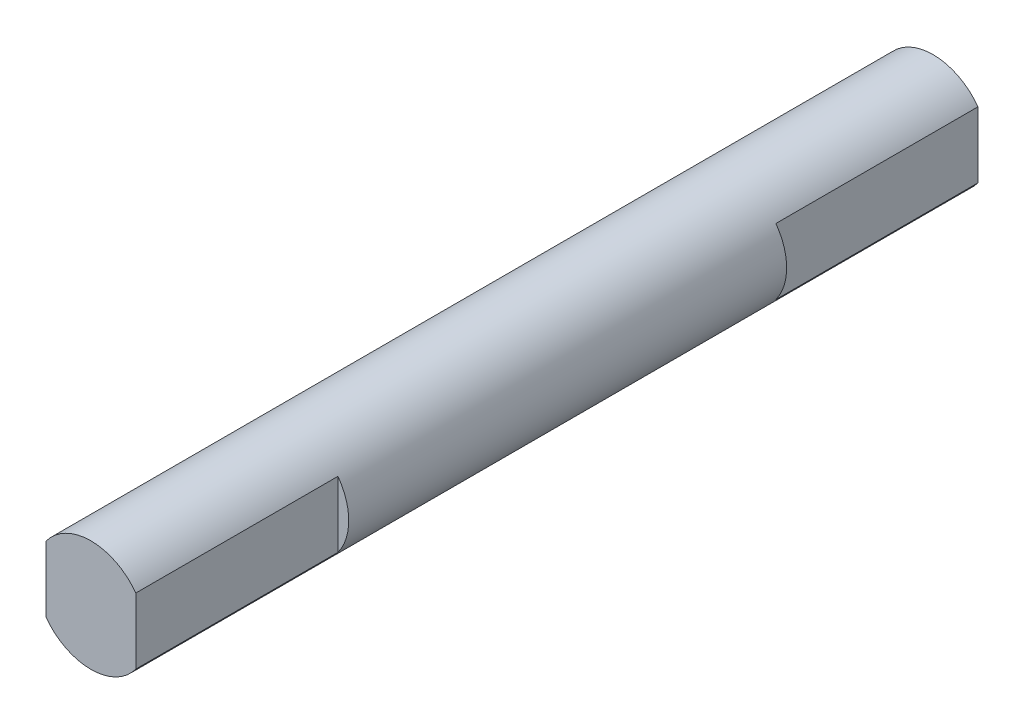
ISO-10303-21;
HEADER;
FILE_DESCRIPTION(('STEP AP214'),'2;1');
FILE_NAME('part.step','',(''),(''),'','','');
FILE_SCHEMA(('AUTOMOTIVE_DESIGN { 1 0 10303 214 1 1 1 1 }'));
ENDSEC;
DATA;
#1=APPLICATION_CONTEXT('core data for automotive mechanical design processes');
#2=APPLICATION_PROTOCOL_DEFINITION('international standard','automotive_design',2000,#1);
#3=PRODUCT_CONTEXT('',#1,'mechanical');
#4=PRODUCT('Part','Part','',(#3));
#5=PRODUCT_RELATED_PRODUCT_CATEGORY('part','',(#4));
#6=PRODUCT_DEFINITION_FORMATION('','',#4);
#7=PRODUCT_DEFINITION_CONTEXT('part definition',#1,'design');
#8=PRODUCT_DEFINITION('design','',#6,#7);
#9=PRODUCT_DEFINITION_SHAPE('','',#8);
#10=(LENGTH_UNIT() NAMED_UNIT(*) SI_UNIT(.MILLI.,.METRE.));
#11=(NAMED_UNIT(*) PLANE_ANGLE_UNIT() SI_UNIT($,.RADIAN.));
#12=(NAMED_UNIT(*) SI_UNIT($,.STERADIAN.) SOLID_ANGLE_UNIT());
#13=UNCERTAINTY_MEASURE_WITH_UNIT(LENGTH_MEASURE(1.E-05),#10,'distance_accuracy_value','');
#14=(GEOMETRIC_REPRESENTATION_CONTEXT(3) GLOBAL_UNCERTAINTY_ASSIGNED_CONTEXT((#13)) GLOBAL_UNIT_ASSIGNED_CONTEXT((#10,
#11,#12)) REPRESENTATION_CONTEXT('',''));
#15=CARTESIAN_POINT('',(0.,0.,0.));
#16=DIRECTION('',(0.,0.,1.));
#17=DIRECTION('',(1.,0.,0.));
#18=AXIS2_PLACEMENT_3D('',#15,#16,#17);
#19=CARTESIAN_POINT('',(0.,0.,-6.5));
#20=DIRECTION('',(0.,0.,-1.));
#21=DIRECTION('',(-1.,0.,0.));
#22=AXIS2_PLACEMENT_3D('',#19,#20,#21);
#23=PLANE('',#22);
#24=CARTESIAN_POINT('',(0.,0.,-6.5));
#25=DIRECTION('',(0.,0.,-1.));
#26=DIRECTION('',(-1.,0.,0.));
#27=AXIS2_PLACEMENT_3D('',#24,#25,#26);
#28=CIRCLE('',#27,2.48);
#29=CARTESIAN_POINT('',(-2.,-1.46642422238587,-6.5));
#30=VERTEX_POINT('',#29);
#31=CARTESIAN_POINT('',(-2.,1.46642422238587,-6.5));
#32=VERTEX_POINT('',#31);
#33=EDGE_CURVE('E110',#30,#32,#28,.T.);
#34=ORIENTED_EDGE('',*,*,#33,.T.);
#35=DIRECTION('',(0.,-1.,0.));
#36=VECTOR('',#35,1.);
#37=CARTESIAN_POINT('',(-2.,0.,-6.5));
#38=LINE('',#37,#36);
#39=EDGE_CURVE('E53',#32,#30,#38,.T.);
#40=ORIENTED_EDGE('',*,*,#39,.T.);
#41=EDGE_LOOP('',(#34,#40));
#42=FACE_BOUND('',#41,.T.);
#43=ADVANCED_FACE('F39',(#42),#23,.T.);
#44=CARTESIAN_POINT('',(0.,0.,13.));
#45=DIRECTION('',(0.,0.,1.));
#46=DIRECTION('',(1.,0.,0.));
#47=AXIS2_PLACEMENT_3D('',#44,#45,#46);
#48=PLANE('',#47);
#49=CARTESIAN_POINT('',(0.,0.,13.));
#50=DIRECTION('',(0.,0.,1.));
#51=DIRECTION('',(1.,0.,0.));
#52=AXIS2_PLACEMENT_3D('',#49,#50,#51);
#53=CIRCLE('',#52,2.48);
#54=CARTESIAN_POINT('',(2.,-1.46642422238587,13.));
#55=VERTEX_POINT('',#54);
#56=CARTESIAN_POINT('',(2.,1.46642422238587,13.));
#57=VERTEX_POINT('',#56);
#58=EDGE_CURVE('E43',#55,#57,#53,.T.);
#59=ORIENTED_EDGE('',*,*,#58,.T.);
#60=DIRECTION('',(0.,-1.,0.));
#61=VECTOR('',#60,1.);
#62=CARTESIAN_POINT('',(2.,0.,13.));
#63=LINE('',#62,#61);
#64=EDGE_CURVE('E146',#57,#55,#63,.T.);
#65=ORIENTED_EDGE('',*,*,#64,.T.);
#66=EDGE_LOOP('',(#59,#65));
#67=FACE_BOUND('',#66,.T.);
#68=ADVANCED_FACE('F165',(#67),#48,.T.);
#69=CARTESIAN_POINT('',(0.,0.,-5.));
#70=DIRECTION('',(0.,0.,1.));
#71=DIRECTION('',(1.,0.,0.));
#72=AXIS2_PLACEMENT_3D('',#69,#70,#71);
#73=CYLINDRICAL_SURFACE('',#72,2.48);
#74=CARTESIAN_POINT('',(-2.,1.46642422238587,13.));
#75=VERTEX_POINT('',#74);
#76=CARTESIAN_POINT('',(-2.,-1.46642422238587,13.));
#77=VERTEX_POINT('',#76);
#78=EDGE_CURVE('E11',#75,#77,#53,.T.);
#79=ORIENTED_EDGE('',*,*,#78,.F.);
#80=DIRECTION('',(0.,0.,-1.));
#81=VECTOR('',#80,1.);
#82=CARTESIAN_POINT('',(-2.,1.46642422238587,22.));
#83=LINE('',#82,#81);
#84=CARTESIAN_POINT('',(-2.,1.46642422238587,22.));
#85=VERTEX_POINT('',#84);
#86=EDGE_CURVE('E156',#85,#75,#83,.T.);
#87=ORIENTED_EDGE('',*,*,#86,.F.);
#88=CARTESIAN_POINT('',(0.,0.,22.));
#89=DIRECTION('',(0.,0.,1.));
#90=DIRECTION('',(1.,0.,0.));
#91=AXIS2_PLACEMENT_3D('',#88,#89,#90);
#92=CIRCLE('',#91,2.48);
#93=CARTESIAN_POINT('',(2.,1.46642422238587,22.));
#94=VERTEX_POINT('',#93);
#95=EDGE_CURVE('E140',#94,#85,#92,.T.);
#96=ORIENTED_EDGE('',*,*,#95,.F.);
#97=DIRECTION('',(0.,0.,-1.));
#98=VECTOR('',#97,1.);
#99=CARTESIAN_POINT('',(2.,1.46642422238587,22.));
#100=LINE('',#99,#98);
#101=EDGE_CURVE('E158',#94,#57,#100,.T.);
#102=ORIENTED_EDGE('',*,*,#101,.T.);
#103=ORIENTED_EDGE('',*,*,#58,.F.);
#104=DIRECTION('',(0.,0.,-1.));
#105=VECTOR('',#104,1.);
#106=CARTESIAN_POINT('',(2.,-1.46642422238587,22.));
#107=LINE('',#106,#105);
#108=CARTESIAN_POINT('',(2.,-1.46642422238587,22.));
#109=VERTEX_POINT('',#108);
#110=EDGE_CURVE('E150',#109,#55,#107,.T.);
#111=ORIENTED_EDGE('',*,*,#110,.F.);
#112=CARTESIAN_POINT('',(-2.,-1.46642422238587,22.));
#113=VERTEX_POINT('',#112);
#114=EDGE_CURVE('E144',#113,#109,#92,.T.);
#115=ORIENTED_EDGE('',*,*,#114,.F.);
#116=DIRECTION('',(0.,0.,-1.));
#117=VECTOR('',#116,1.);
#118=CARTESIAN_POINT('',(-2.,-1.46642422238587,22.));
#119=LINE('',#118,#117);
#120=EDGE_CURVE('E153',#113,#77,#119,.T.);
#121=ORIENTED_EDGE('',*,*,#120,.T.);
#122=EDGE_LOOP('',(#79,#87,#96,#102,#103,#111,#115,#121));
#123=FACE_BOUND('',#122,.T.);
#124=CARTESIAN_POINT('',(2.,1.46642422238587,-6.5));
#125=VERTEX_POINT('',#124);
#126=CARTESIAN_POINT('',(2.,-1.46642422238587,-6.5));
#127=VERTEX_POINT('',#126);
#128=EDGE_CURVE('E136',#125,#127,#28,.T.);
#129=ORIENTED_EDGE('',*,*,#128,.F.);
#130=DIRECTION('',(0.,0.,1.));
#131=VECTOR('',#130,1.);
#132=CARTESIAN_POINT('',(2.,1.46642422238587,-15.5));
#133=LINE('',#132,#131);
#134=CARTESIAN_POINT('',(2.,1.46642422238587,-15.5));
#135=VERTEX_POINT('',#134);
#136=EDGE_CURVE('E111',#135,#125,#133,.T.);
#137=ORIENTED_EDGE('',*,*,#136,.F.);
#138=CARTESIAN_POINT('',(0.,0.,-15.5));
#139=DIRECTION('',(0.,0.,-1.));
#140=DIRECTION('',(-1.,0.,0.));
#141=AXIS2_PLACEMENT_3D('',#138,#139,#140);
#142=CIRCLE('',#141,2.48);
#143=CARTESIAN_POINT('',(-2.,1.46642422238587,-15.5));
#144=VERTEX_POINT('',#143);
#145=EDGE_CURVE('E114',#144,#135,#142,.T.);
#146=ORIENTED_EDGE('',*,*,#145,.F.);
#147=DIRECTION('',(0.,0.,1.));
#148=VECTOR('',#147,1.);
#149=CARTESIAN_POINT('',(-2.,1.46642422238587,-15.5));
#150=LINE('',#149,#148);
#151=EDGE_CURVE('E103',#144,#32,#150,.T.);
#152=ORIENTED_EDGE('',*,*,#151,.T.);
#153=ORIENTED_EDGE('',*,*,#33,.F.);
#154=DIRECTION('',(0.,0.,1.));
#155=VECTOR('',#154,1.);
#156=CARTESIAN_POINT('',(-2.,-1.46642422238587,-15.5));
#157=LINE('',#156,#155);
#158=CARTESIAN_POINT('',(-2.,-1.46642422238587,-15.5));
#159=VERTEX_POINT('',#158);
#160=EDGE_CURVE('E129',#159,#30,#157,.T.);
#161=ORIENTED_EDGE('',*,*,#160,.F.);
#162=CARTESIAN_POINT('',(2.,-1.46642422238587,-15.5));
#163=VERTEX_POINT('',#162);
#164=EDGE_CURVE('E120',#163,#159,#142,.T.);
#165=ORIENTED_EDGE('',*,*,#164,.F.);
#166=DIRECTION('',(0.,0.,1.));
#167=VECTOR('',#166,1.);
#168=CARTESIAN_POINT('',(2.,-1.46642422238587,-15.5));
#169=LINE('',#168,#167);
#170=EDGE_CURVE('E131',#163,#127,#169,.T.);
#171=ORIENTED_EDGE('',*,*,#170,.T.);
#172=EDGE_LOOP('',(#129,#137,#146,#152,#153,#161,#165,#171));
#173=FACE_BOUND('',#172,.T.);
#174=ADVANCED_FACE('F41',(#123,#173),#73,.T.);
#175=DIRECTION('',(0.,-1.,0.));
#176=VECTOR('',#175,1.);
#177=CARTESIAN_POINT('',(-2.,0.,13.));
#178=LINE('',#177,#176);
#179=EDGE_CURVE('E141',#75,#77,#178,.T.);
#180=ORIENTED_EDGE('',*,*,#179,.F.);
#181=ORIENTED_EDGE('',*,*,#78,.T.);
#182=EDGE_LOOP('',(#180,#181));
#183=FACE_BOUND('',#182,.T.);
#184=ADVANCED_FACE('F180',(#183),#48,.T.);
#185=CARTESIAN_POINT('',(2.,0.,22.));
#186=DIRECTION('',(1.,0.,0.));
#187=DIRECTION('',(0.,0.,-1.));
#188=AXIS2_PLACEMENT_3D('',#185,#186,#187);
#189=PLANE('',#188);
#190=ORIENTED_EDGE('',*,*,#64,.F.);
#191=ORIENTED_EDGE('',*,*,#101,.F.);
#192=DIRECTION('',(0.,-1.,0.));
#193=VECTOR('',#192,1.);
#194=CARTESIAN_POINT('',(2.,0.,22.));
#195=LINE('',#194,#193);
#196=EDGE_CURVE('E137',#94,#109,#195,.T.);
#197=ORIENTED_EDGE('',*,*,#196,.T.);
#198=ORIENTED_EDGE('',*,*,#110,.T.);
#199=EDGE_LOOP('',(#190,#191,#197,#198));
#200=FACE_BOUND('',#199,.T.);
#201=ADVANCED_FACE('F170',(#200),#189,.T.);
#202=CARTESIAN_POINT('',(-2.,0.,22.));
#203=DIRECTION('',(1.,0.,0.));
#204=DIRECTION('',(0.,0.,-1.));
#205=AXIS2_PLACEMENT_3D('',#202,#203,#204);
#206=PLANE('',#205);
#207=ORIENTED_EDGE('',*,*,#179,.T.);
#208=ORIENTED_EDGE('',*,*,#120,.F.);
#209=DIRECTION('',(0.,-1.,0.));
#210=VECTOR('',#209,1.);
#211=CARTESIAN_POINT('',(-2.,0.,22.));
#212=LINE('',#211,#210);
#213=EDGE_CURVE('E143',#85,#113,#212,.T.);
#214=ORIENTED_EDGE('',*,*,#213,.F.);
#215=ORIENTED_EDGE('',*,*,#86,.T.);
#216=EDGE_LOOP('',(#207,#208,#214,#215));
#217=FACE_BOUND('',#216,.T.);
#218=ADVANCED_FACE('F178',(#217),#206,.F.);
#219=CARTESIAN_POINT('',(0.,0.,22.));
#220=DIRECTION('',(0.,0.,1.));
#221=DIRECTION('',(1.,0.,0.));
#222=AXIS2_PLACEMENT_3D('',#219,#220,#221);
#223=PLANE('',#222);
#224=ORIENTED_EDGE('',*,*,#196,.F.);
#225=ORIENTED_EDGE('',*,*,#95,.T.);
#226=ORIENTED_EDGE('',*,*,#213,.T.);
#227=ORIENTED_EDGE('',*,*,#114,.T.);
#228=EDGE_LOOP('',(#224,#225,#226,#227));
#229=FACE_BOUND('',#228,.T.);
#230=ADVANCED_FACE('F173',(#229),#223,.T.);
#231=DIRECTION('',(0.,-1.,0.));
#232=VECTOR('',#231,1.);
#233=CARTESIAN_POINT('',(2.,0.,-6.5));
#234=LINE('',#233,#232);
#235=EDGE_CURVE('E60',#125,#127,#234,.T.);
#236=ORIENTED_EDGE('',*,*,#235,.F.);
#237=ORIENTED_EDGE('',*,*,#128,.T.);
#238=EDGE_LOOP('',(#236,#237));
#239=FACE_BOUND('',#238,.T.);
#240=ADVANCED_FACE('F190',(#239),#23,.T.);
#241=CARTESIAN_POINT('',(-2.,0.,-15.5));
#242=DIRECTION('',(-1.,0.,0.));
#243=DIRECTION('',(0.,0.,1.));
#244=AXIS2_PLACEMENT_3D('',#241,#242,#243);
#245=PLANE('',#244);
#246=ORIENTED_EDGE('',*,*,#39,.F.);
#247=ORIENTED_EDGE('',*,*,#151,.F.);
#248=DIRECTION('',(0.,-1.,0.));
#249=VECTOR('',#248,1.);
#250=CARTESIAN_POINT('',(-2.,0.,-15.5));
#251=LINE('',#250,#249);
#252=EDGE_CURVE('E108',#144,#159,#251,.T.);
#253=ORIENTED_EDGE('',*,*,#252,.T.);
#254=ORIENTED_EDGE('',*,*,#160,.T.);
#255=EDGE_LOOP('',(#246,#247,#253,#254));
#256=FACE_BOUND('',#255,.T.);
#257=ADVANCED_FACE('F105',(#256),#245,.T.);
#258=CARTESIAN_POINT('',(2.,0.,-15.5));
#259=DIRECTION('',(-1.,0.,0.));
#260=DIRECTION('',(0.,0.,1.));
#261=AXIS2_PLACEMENT_3D('',#258,#259,#260);
#262=PLANE('',#261);
#263=ORIENTED_EDGE('',*,*,#235,.T.);
#264=ORIENTED_EDGE('',*,*,#170,.F.);
#265=DIRECTION('',(0.,-1.,0.));
#266=VECTOR('',#265,1.);
#267=CARTESIAN_POINT('',(2.,0.,-15.5));
#268=LINE('',#267,#266);
#269=EDGE_CURVE('E118',#135,#163,#268,.T.);
#270=ORIENTED_EDGE('',*,*,#269,.F.);
#271=ORIENTED_EDGE('',*,*,#136,.T.);
#272=EDGE_LOOP('',(#263,#264,#270,#271));
#273=FACE_BOUND('',#272,.T.);
#274=ADVANCED_FACE('F200',(#273),#262,.F.);
#275=CARTESIAN_POINT('',(0.,0.,-15.5));
#276=DIRECTION('',(0.,0.,-1.));
#277=DIRECTION('',(-1.,0.,0.));
#278=AXIS2_PLACEMENT_3D('',#275,#276,#277);
#279=PLANE('',#278);
#280=ORIENTED_EDGE('',*,*,#252,.F.);
#281=ORIENTED_EDGE('',*,*,#145,.T.);
#282=ORIENTED_EDGE('',*,*,#269,.T.);
#283=ORIENTED_EDGE('',*,*,#164,.T.);
#284=EDGE_LOOP('',(#280,#281,#282,#283));
#285=FACE_BOUND('',#284,.T.);
#286=ADVANCED_FACE('F121',(#285),#279,.T.);
#287=CLOSED_SHELL('',(#43,#68,#174,#184,#201,#218,#230,#240,#257,#274,#286));
#288=MANIFOLD_SOLID_BREP('B2',#287);
#289=ADVANCED_BREP_SHAPE_REPRESENTATION('',(#18,#288),#14);
#290=SHAPE_DEFINITION_REPRESENTATION(#9,#289);
ENDSEC;
END-ISO-10303-21;
